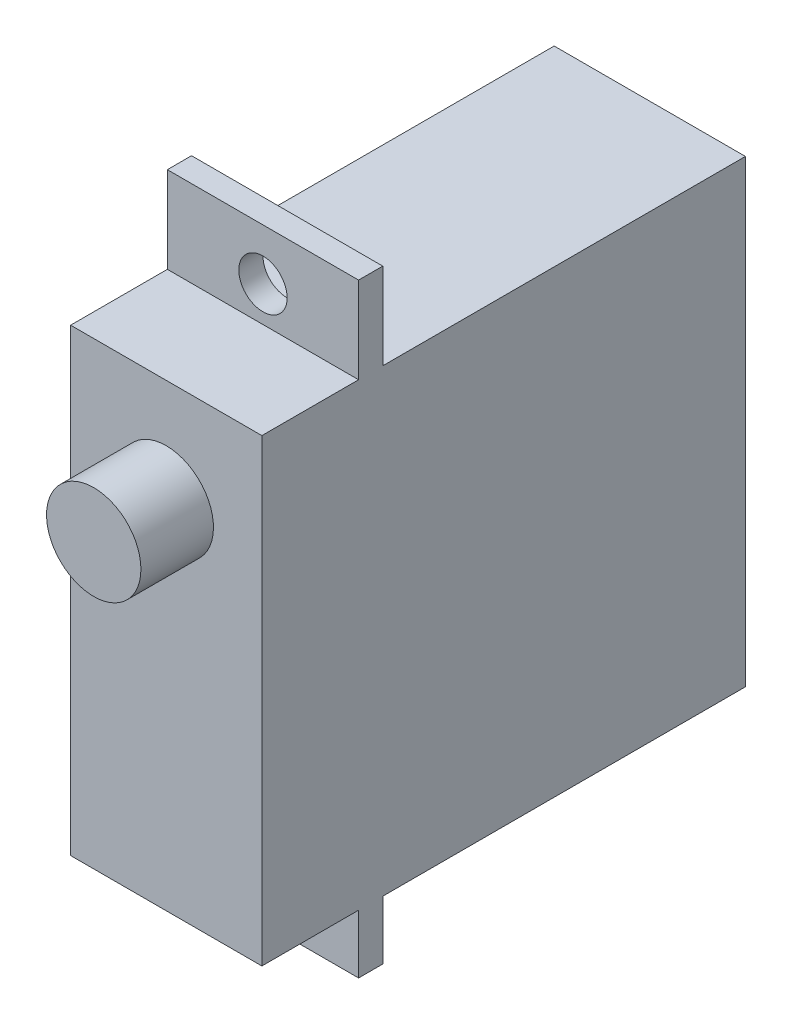
ISO-10303-21;
HEADER;
FILE_DESCRIPTION(('STEP AP214'),'2;1');
FILE_NAME('part.step','',(''),(''),'','','');
FILE_SCHEMA(('AUTOMOTIVE_DESIGN { 1 0 10303 214 1 1 1 1 }'));
ENDSEC;
DATA;
#1=APPLICATION_CONTEXT('core data for automotive mechanical design processes');
#2=APPLICATION_PROTOCOL_DEFINITION('international standard','automotive_design',2000,#1);
#3=PRODUCT_CONTEXT('',#1,'mechanical');
#4=PRODUCT('Part','Part','',(#3));
#5=PRODUCT_RELATED_PRODUCT_CATEGORY('part','',(#4));
#6=PRODUCT_DEFINITION_FORMATION('','',#4);
#7=PRODUCT_DEFINITION_CONTEXT('part definition',#1,'design');
#8=PRODUCT_DEFINITION('design','',#6,#7);
#9=PRODUCT_DEFINITION_SHAPE('','',#8);
#10=(LENGTH_UNIT() NAMED_UNIT(*) SI_UNIT(.MILLI.,.METRE.));
#11=(NAMED_UNIT(*) PLANE_ANGLE_UNIT() SI_UNIT($,.RADIAN.));
#12=(NAMED_UNIT(*) SI_UNIT($,.STERADIAN.) SOLID_ANGLE_UNIT());
#13=UNCERTAINTY_MEASURE_WITH_UNIT(LENGTH_MEASURE(1.E-05),#10,'distance_accuracy_value','');
#14=(GEOMETRIC_REPRESENTATION_CONTEXT(3) GLOBAL_UNCERTAINTY_ASSIGNED_CONTEXT((#13)) GLOBAL_UNIT_ASSIGNED_CONTEXT((#10,
#11,#12)) REPRESENTATION_CONTEXT('',''));
#15=CARTESIAN_POINT('',(0.,0.,0.));
#16=DIRECTION('',(0.,0.,1.));
#17=DIRECTION('',(1.,0.,0.));
#18=AXIS2_PLACEMENT_3D('',#15,#16,#17);
#19=CARTESIAN_POINT('',(-25.0199920063936,-5.80547918733974,13.9600080226867));
#20=DIRECTION('',(0.,-1.,0.));
#21=DIRECTION('',(0.,0.,-1.));
#22=AXIS2_PLACEMENT_3D('',#19,#20,#21);
#23=PLANE('',#22);
#24=DIRECTION('',(0.,0.,1.));
#25=VECTOR('',#24,1.);
#26=CARTESIAN_POINT('',(4.17861745802361,-5.80547918733976,-7.93999197731334));
#27=LINE('',#26,#25);
#28=CARTESIAN_POINT('',(4.17861745802369,-5.80547918733974,12.9600080226867));
#29=VERTEX_POINT('',#28);
#30=CARTESIAN_POINT('',(4.17861745802369,-5.80547918733974,13.9600080226867));
#31=VERTEX_POINT('',#30);
#32=EDGE_CURVE('E50',#29,#31,#27,.T.);
#33=ORIENTED_EDGE('',*,*,#32,.F.);
#34=DIRECTION('',(1.,0.,0.));
#35=VECTOR('',#34,1.);
#36=CARTESIAN_POINT('',(-25.0199920063936,-5.80547918733974,12.9600080226867));
#37=LINE('',#36,#35);
#38=CARTESIAN_POINT('',(7.91,-5.80547918733974,12.9600080226867));
#39=VERTEX_POINT('',#38);
#40=EDGE_CURVE('E157',#29,#39,#37,.T.);
#41=ORIENTED_EDGE('',*,*,#40,.T.);
#42=DIRECTION('',(0.,0.,-1.));
#43=VECTOR('',#42,1.);
#44=CARTESIAN_POINT('',(7.91,-5.80547918733974,13.9600080226867));
#45=LINE('',#44,#43);
#46=CARTESIAN_POINT('',(7.91,-5.80547918733974,13.9600080226867));
#47=VERTEX_POINT('',#46);
#48=EDGE_CURVE('E238',#47,#39,#45,.T.);
#49=ORIENTED_EDGE('',*,*,#48,.F.);
#50=DIRECTION('',(1.,0.,0.));
#51=VECTOR('',#50,1.);
#52=CARTESIAN_POINT('',(-25.0199920063936,-5.80547918733974,13.9600080226867));
#53=LINE('',#52,#51);
#54=EDGE_CURVE('E158',#31,#47,#53,.T.);
#55=ORIENTED_EDGE('',*,*,#54,.F.);
#56=EDGE_LOOP('',(#33,#41,#49,#55));
#57=FACE_BOUND('',#56,.T.);
#58=ADVANCED_FACE('F35',(#57),#23,.T.);
#59=CARTESIAN_POINT('',(7.91,15.6241978014453,17.9600080226867));
#60=DIRECTION('',(0.,-1.,0.));
#61=DIRECTION('',(0.,0.,-1.));
#62=AXIS2_PLACEMENT_3D('',#59,#60,#61);
#63=PLANE('',#62);
#64=DIRECTION('',(-1.,0.,0.));
#65=VECTOR('',#64,1.);
#66=CARTESIAN_POINT('',(7.91,15.6241978014453,12.9600080226867));
#67=LINE('',#66,#65);
#68=CARTESIAN_POINT('',(7.91,15.6241978014453,12.9600080226867));
#69=VERTEX_POINT('',#68);
#70=CARTESIAN_POINT('',(0.,15.6241978014453,12.9600080226867));
#71=VERTEX_POINT('',#70);
#72=EDGE_CURVE('E168',#69,#71,#67,.T.);
#73=ORIENTED_EDGE('',*,*,#72,.F.);
#74=DIRECTION('',(0.,0.,1.));
#75=VECTOR('',#74,1.);
#76=CARTESIAN_POINT('',(7.91,15.6241978014453,17.9600080226867));
#77=LINE('',#76,#75);
#78=CARTESIAN_POINT('',(7.91,15.6241978014453,-2.03999197731334));
#79=VERTEX_POINT('',#78);
#80=EDGE_CURVE('E182',#79,#69,#77,.T.);
#81=ORIENTED_EDGE('',*,*,#80,.F.);
#82=DIRECTION('',(-1.,0.,0.));
#83=VECTOR('',#82,1.);
#84=CARTESIAN_POINT('',(7.91,15.6241978014453,-2.03999197731334));
#85=LINE('',#84,#83);
#86=CARTESIAN_POINT('',(0.,15.6241978014453,-2.03999197731334));
#87=VERTEX_POINT('',#86);
#88=EDGE_CURVE('E141',#79,#87,#85,.T.);
#89=ORIENTED_EDGE('',*,*,#88,.T.);
#90=DIRECTION('',(0.,0.,1.));
#91=VECTOR('',#90,1.);
#92=CARTESIAN_POINT('',(0.,15.6241978014453,17.9600080226867));
#93=LINE('',#92,#91);
#94=EDGE_CURVE('E194',#87,#71,#93,.T.);
#95=ORIENTED_EDGE('',*,*,#94,.T.);
#96=EDGE_LOOP('',(#73,#81,#89,#95));
#97=FACE_BOUND('',#96,.T.);
#98=ADVANCED_FACE('F265',(#97),#63,.F.);
#99=CARTESIAN_POINT('',(7.91,-3.37580219855472,17.9600080226867));
#100=DIRECTION('',(0.,1.,0.));
#101=DIRECTION('',(0.,0.,1.));
#102=AXIS2_PLACEMENT_3D('',#99,#100,#101);
#103=PLANE('',#102);
#104=DIRECTION('',(1.,0.,0.));
#105=VECTOR('',#104,1.);
#106=CARTESIAN_POINT('',(7.91,-3.37580219855472,12.9600080226867));
#107=LINE('',#106,#105);
#108=CARTESIAN_POINT('',(0.,-3.37580219855472,12.9600080226867));
#109=VERTEX_POINT('',#108);
#110=CARTESIAN_POINT('',(7.91,-3.37580219855472,12.9600080226867));
#111=VERTEX_POINT('',#110);
#112=EDGE_CURVE('E166',#109,#111,#107,.T.);
#113=ORIENTED_EDGE('',*,*,#112,.F.);
#114=DIRECTION('',(0.,0.,-1.));
#115=VECTOR('',#114,1.);
#116=CARTESIAN_POINT('',(0.,-3.37580219855472,17.9600080226867));
#117=LINE('',#116,#115);
#118=CARTESIAN_POINT('',(0.,-3.37580219855472,-2.03999197731334));
#119=VERTEX_POINT('',#118);
#120=EDGE_CURVE('E198',#109,#119,#117,.T.);
#121=ORIENTED_EDGE('',*,*,#120,.T.);
#122=DIRECTION('',(-1.,0.,0.));
#123=VECTOR('',#122,1.);
#124=CARTESIAN_POINT('',(7.91,-3.37580219855472,-2.03999197731334));
#125=LINE('',#124,#123);
#126=CARTESIAN_POINT('',(7.91,-3.37580219855472,-2.03999197731334));
#127=VERTEX_POINT('',#126);
#128=EDGE_CURVE('E190',#127,#119,#125,.T.);
#129=ORIENTED_EDGE('',*,*,#128,.F.);
#130=DIRECTION('',(0.,0.,-1.));
#131=VECTOR('',#130,1.);
#132=CARTESIAN_POINT('',(7.91,-3.37580219855472,17.9600080226867));
#133=LINE('',#132,#131);
#134=EDGE_CURVE('E58',#111,#127,#133,.T.);
#135=ORIENTED_EDGE('',*,*,#134,.F.);
#136=EDGE_LOOP('',(#113,#121,#129,#135));
#137=FACE_BOUND('',#136,.T.);
#138=ADVANCED_FACE('F294',(#137),#103,.F.);
#139=CARTESIAN_POINT('',(7.91,15.6241978014453,-2.03999197731334));
#140=DIRECTION('',(0.,0.,1.));
#141=DIRECTION('',(0.,-1.,0.));
#142=AXIS2_PLACEMENT_3D('',#139,#140,#141);
#143=PLANE('',#142);
#144=DIRECTION('',(0.,1.,0.));
#145=VECTOR('',#144,1.);
#146=CARTESIAN_POINT('',(0.,15.6241978014453,-2.03999197731334));
#147=LINE('',#146,#145);
#148=EDGE_CURVE('E176',#119,#87,#147,.T.);
#149=ORIENTED_EDGE('',*,*,#148,.T.);
#150=ORIENTED_EDGE('',*,*,#88,.F.);
#151=DIRECTION('',(0.,1.,0.));
#152=VECTOR('',#151,1.);
#153=CARTESIAN_POINT('',(7.91,15.6241978014453,-2.03999197731334));
#154=LINE('',#153,#152);
#155=EDGE_CURVE('E177',#127,#79,#154,.T.);
#156=ORIENTED_EDGE('',*,*,#155,.F.);
#157=ORIENTED_EDGE('',*,*,#128,.T.);
#158=EDGE_LOOP('',(#149,#150,#156,#157));
#159=FACE_BOUND('',#158,.T.);
#160=ADVANCED_FACE('F37',(#159),#143,.F.);
#161=CARTESIAN_POINT('',(7.91,15.6241978014453,13.9600080226867));
#162=VERTEX_POINT('',#161);
#163=CARTESIAN_POINT('',(7.91,15.6241978014453,17.9600080226867));
#164=VERTEX_POINT('',#163);
#165=EDGE_CURVE('E180',#162,#164,#77,.T.);
#166=ORIENTED_EDGE('',*,*,#165,.F.);
#167=DIRECTION('',(-1.,0.,0.));
#168=VECTOR('',#167,1.);
#169=CARTESIAN_POINT('',(7.91,15.6241978014453,13.9600080226867));
#170=LINE('',#169,#168);
#171=CARTESIAN_POINT('',(0.,15.6241978014453,13.9600080226867));
#172=VERTEX_POINT('',#171);
#173=EDGE_CURVE('E173',#162,#172,#170,.T.);
#174=ORIENTED_EDGE('',*,*,#173,.T.);
#175=CARTESIAN_POINT('',(0.,15.6241978014453,17.9600080226867));
#176=VERTEX_POINT('',#175);
#177=EDGE_CURVE('E193',#172,#176,#93,.T.);
#178=ORIENTED_EDGE('',*,*,#177,.T.);
#179=DIRECTION('',(-1.,0.,0.));
#180=VECTOR('',#179,1.);
#181=CARTESIAN_POINT('',(7.91,15.6241978014453,17.9600080226867));
#182=LINE('',#181,#180);
#183=EDGE_CURVE('E205',#164,#176,#182,.T.);
#184=ORIENTED_EDGE('',*,*,#183,.F.);
#185=EDGE_LOOP('',(#166,#174,#178,#184));
#186=FACE_BOUND('',#185,.T.);
#187=ADVANCED_FACE('F277',(#186),#63,.F.);
#188=CARTESIAN_POINT('',(7.91,15.6241978014453,17.9600080226867));
#189=DIRECTION('',(0.,0.,-1.));
#190=DIRECTION('',(0.,1.,0.));
#191=AXIS2_PLACEMENT_3D('',#188,#189,#190);
#192=PLANE('',#191);
#193=CARTESIAN_POINT('',(3.955,11.3331948655234,17.9600080226867));
#194=DIRECTION('',(0.,0.,-1.));
#195=DIRECTION('',(0.,1.,0.));
#196=AXIS2_PLACEMENT_3D('',#193,#194,#195);
#197=CIRCLE('',#196,1.95158077469917);
#198=CARTESIAN_POINT('',(3.955,13.2847756402225,17.9600080226867));
#199=VERTEX_POINT('',#198);
#200=EDGE_CURVE('E11',#199,#199,#197,.F.);
#201=ORIENTED_EDGE('',*,*,#200,.F.);
#202=EDGE_LOOP('',(#201));
#203=FACE_BOUND('',#202,.T.);
#204=DIRECTION('',(0.,-1.,0.));
#205=VECTOR('',#204,1.);
#206=CARTESIAN_POINT('',(0.,15.6241978014453,17.9600080226867));
#207=LINE('',#206,#205);
#208=CARTESIAN_POINT('',(0.,-3.37580219855472,17.9600080226867));
#209=VERTEX_POINT('',#208);
#210=EDGE_CURVE('E196',#176,#209,#207,.T.);
#211=ORIENTED_EDGE('',*,*,#210,.T.);
#212=DIRECTION('',(-1.,0.,0.));
#213=VECTOR('',#212,1.);
#214=CARTESIAN_POINT('',(7.91,-3.37580219855472,17.9600080226867));
#215=LINE('',#214,#213);
#216=CARTESIAN_POINT('',(7.91,-3.37580219855472,17.9600080226867));
#217=VERTEX_POINT('',#216);
#218=EDGE_CURVE('E202',#217,#209,#215,.T.);
#219=ORIENTED_EDGE('',*,*,#218,.F.);
#220=DIRECTION('',(0.,-1.,0.));
#221=VECTOR('',#220,1.);
#222=CARTESIAN_POINT('',(7.91,15.6241978014453,17.9600080226867));
#223=LINE('',#222,#221);
#224=EDGE_CURVE('E185',#164,#217,#223,.T.);
#225=ORIENTED_EDGE('',*,*,#224,.F.);
#226=ORIENTED_EDGE('',*,*,#183,.T.);
#227=EDGE_LOOP('',(#211,#219,#225,#226));
#228=FACE_BOUND('',#227,.T.);
#229=ADVANCED_FACE('F280',(#203,#228),#192,.F.);
#230=CARTESIAN_POINT('',(0.,-3.37580219855472,13.9600080226867));
#231=VERTEX_POINT('',#230);
#232=EDGE_CURVE('E181',#209,#231,#117,.T.);
#233=ORIENTED_EDGE('',*,*,#232,.T.);
#234=DIRECTION('',(1.,0.,0.));
#235=VECTOR('',#234,1.);
#236=CARTESIAN_POINT('',(7.91,-3.37580219855472,13.9600080226867));
#237=LINE('',#236,#235);
#238=CARTESIAN_POINT('',(7.91,-3.37580219855472,13.9600080226867));
#239=VERTEX_POINT('',#238);
#240=EDGE_CURVE('E171',#231,#239,#237,.T.);
#241=ORIENTED_EDGE('',*,*,#240,.T.);
#242=EDGE_CURVE('E187',#217,#239,#133,.T.);
#243=ORIENTED_EDGE('',*,*,#242,.F.);
#244=ORIENTED_EDGE('',*,*,#218,.T.);
#245=EDGE_LOOP('',(#233,#241,#243,#244));
#246=FACE_BOUND('',#245,.T.);
#247=ADVANCED_FACE('F284',(#246),#103,.F.);
#248=CARTESIAN_POINT('',(7.91,0.,0.));
#249=DIRECTION('',(1.,0.,0.));
#250=DIRECTION('',(0.,0.,-1.));
#251=AXIS2_PLACEMENT_3D('',#248,#249,#250);
#252=PLANE('',#251);
#253=ORIENTED_EDGE('',*,*,#242,.T.);
#254=DIRECTION('',(0.,-1.,0.));
#255=VECTOR('',#254,1.);
#256=CARTESIAN_POINT('',(7.91,19.1945208126603,13.9600080226867));
#257=LINE('',#256,#255);
#258=EDGE_CURVE('E225',#239,#47,#257,.T.);
#259=ORIENTED_EDGE('',*,*,#258,.T.);
#260=ORIENTED_EDGE('',*,*,#48,.T.);
#261=DIRECTION('',(0.,-1.,0.));
#262=VECTOR('',#261,1.);
#263=CARTESIAN_POINT('',(7.91,19.1945208126603,12.9600080226867));
#264=LINE('',#263,#262);
#265=EDGE_CURVE('E241',#111,#39,#264,.T.);
#266=ORIENTED_EDGE('',*,*,#265,.F.);
#267=ORIENTED_EDGE('',*,*,#134,.T.);
#268=ORIENTED_EDGE('',*,*,#155,.T.);
#269=ORIENTED_EDGE('',*,*,#80,.T.);
#270=CARTESIAN_POINT('',(7.91,19.1945208126603,12.9600080226867));
#271=VERTEX_POINT('',#270);
#272=EDGE_CURVE('E242',#271,#69,#264,.T.);
#273=ORIENTED_EDGE('',*,*,#272,.F.);
#274=DIRECTION('',(0.,0.,-1.));
#275=VECTOR('',#274,1.);
#276=CARTESIAN_POINT('',(7.91,19.1945208126603,13.9600080226867));
#277=LINE('',#276,#275);
#278=CARTESIAN_POINT('',(7.91,19.1945208126603,13.9600080226867));
#279=VERTEX_POINT('',#278);
#280=EDGE_CURVE('E161',#279,#271,#277,.T.);
#281=ORIENTED_EDGE('',*,*,#280,.F.);
#282=EDGE_CURVE('E235',#279,#162,#257,.T.);
#283=ORIENTED_EDGE('',*,*,#282,.T.);
#284=ORIENTED_EDGE('',*,*,#165,.T.);
#285=ORIENTED_EDGE('',*,*,#224,.T.);
#286=EDGE_LOOP('',(#253,#259,#260,#266,#267,#268,#269,#273,#281,#283,#284,#285));
#287=FACE_BOUND('',#286,.T.);
#288=ADVANCED_FACE('F261',(#287),#252,.T.);
#289=CARTESIAN_POINT('',(0.,0.,0.));
#290=DIRECTION('',(1.,0.,0.));
#291=DIRECTION('',(0.,0.,-1.));
#292=AXIS2_PLACEMENT_3D('',#289,#290,#291);
#293=PLANE('',#292);
#294=ORIENTED_EDGE('',*,*,#177,.F.);
#295=DIRECTION('',(0.,1.,0.));
#296=VECTOR('',#295,1.);
#297=CARTESIAN_POINT('',(0.,19.1945208126603,13.9600080226867));
#298=LINE('',#297,#296);
#299=CARTESIAN_POINT('',(0.,19.1945208126603,13.9600080226867));
#300=VERTEX_POINT('',#299);
#301=EDGE_CURVE('E233',#172,#300,#298,.T.);
#302=ORIENTED_EDGE('',*,*,#301,.T.);
#303=DIRECTION('',(0.,0.,1.));
#304=VECTOR('',#303,1.);
#305=CARTESIAN_POINT('',(0.,19.1945208126603,13.9600080226867));
#306=LINE('',#305,#304);
#307=CARTESIAN_POINT('',(0.,19.1945208126603,12.9600080226867));
#308=VERTEX_POINT('',#307);
#309=EDGE_CURVE('E229',#308,#300,#306,.T.);
#310=ORIENTED_EDGE('',*,*,#309,.F.);
#311=DIRECTION('',(0.,1.,0.));
#312=VECTOR('',#311,1.);
#313=CARTESIAN_POINT('',(0.,19.1945208126603,12.9600080226867));
#314=LINE('',#313,#312);
#315=EDGE_CURVE('E230',#71,#308,#314,.T.);
#316=ORIENTED_EDGE('',*,*,#315,.F.);
#317=ORIENTED_EDGE('',*,*,#94,.F.);
#318=ORIENTED_EDGE('',*,*,#148,.F.);
#319=ORIENTED_EDGE('',*,*,#120,.F.);
#320=CARTESIAN_POINT('',(0.,-5.80547918733974,12.9600080226867));
#321=VERTEX_POINT('',#320);
#322=EDGE_CURVE('E226',#321,#109,#314,.T.);
#323=ORIENTED_EDGE('',*,*,#322,.F.);
#324=DIRECTION('',(0.,0.,1.));
#325=VECTOR('',#324,1.);
#326=CARTESIAN_POINT('',(0.,-5.80547918733974,13.9600080226867));
#327=LINE('',#326,#325);
#328=CARTESIAN_POINT('',(0.,-5.80547918733974,13.9600080226867));
#329=VERTEX_POINT('',#328);
#330=EDGE_CURVE('E164',#321,#329,#327,.T.);
#331=ORIENTED_EDGE('',*,*,#330,.T.);
#332=EDGE_CURVE('E156',#329,#231,#298,.T.);
#333=ORIENTED_EDGE('',*,*,#332,.T.);
#334=ORIENTED_EDGE('',*,*,#232,.F.);
#335=ORIENTED_EDGE('',*,*,#210,.F.);
#336=EDGE_LOOP('',(#294,#302,#310,#316,#317,#318,#319,#323,#331,#333,#334,#335));
#337=FACE_BOUND('',#336,.T.);
#338=ADVANCED_FACE('F267',(#337),#293,.F.);
#339=DIRECTION('',(0.,0.,1.));
#340=VECTOR('',#339,1.);
#341=CARTESIAN_POINT('',(3.73138254197639,-5.80547918733976,-7.93999197731334));
#342=LINE('',#341,#340);
#343=CARTESIAN_POINT('',(3.73138254197631,-5.80547918733974,13.9600080226867));
#344=VERTEX_POINT('',#343);
#345=CARTESIAN_POINT('',(3.73138254197631,-5.80547918733974,12.9600080226867));
#346=VERTEX_POINT('',#345);
#347=EDGE_CURVE('E136',#344,#346,#342,.F.);
#348=ORIENTED_EDGE('',*,*,#347,.F.);
#349=EDGE_CURVE('E147',#329,#344,#53,.T.);
#350=ORIENTED_EDGE('',*,*,#349,.F.);
#351=ORIENTED_EDGE('',*,*,#330,.F.);
#352=EDGE_CURVE('E149',#321,#346,#37,.T.);
#353=ORIENTED_EDGE('',*,*,#352,.T.);
#354=EDGE_LOOP('',(#348,#350,#351,#353));
#355=FACE_BOUND('',#354,.T.);
#356=ADVANCED_FACE('F145',(#355),#23,.T.);
#357=CARTESIAN_POINT('',(-25.0199920063936,19.1945208126603,12.9600080226867));
#358=DIRECTION('',(0.,0.,1.));
#359=DIRECTION('',(0.,-1.,0.));
#360=AXIS2_PLACEMENT_3D('',#357,#358,#359);
#361=PLANE('',#360);
#362=ORIENTED_EDGE('',*,*,#40,.F.);
#363=CARTESIAN_POINT('',(3.955,-4.83080219855472,12.9600080226867));
#364=DIRECTION('',(0.,0.,1.));
#365=DIRECTION('',(0.,-1.,0.));
#366=AXIS2_PLACEMENT_3D('',#363,#364,#365);
#367=CIRCLE('',#366,1.);
#368=EDGE_CURVE('E150',#29,#346,#367,.T.);
#369=ORIENTED_EDGE('',*,*,#368,.T.);
#370=ORIENTED_EDGE('',*,*,#352,.F.);
#371=ORIENTED_EDGE('',*,*,#322,.T.);
#372=ORIENTED_EDGE('',*,*,#112,.T.);
#373=ORIENTED_EDGE('',*,*,#265,.T.);
#374=EDGE_LOOP('',(#362,#369,#370,#371,#372,#373));
#375=FACE_BOUND('',#374,.T.);
#376=ADVANCED_FACE('F293',(#375),#361,.F.);
#377=CARTESIAN_POINT('',(-25.0199920063936,19.1945208126603,13.9600080226867));
#378=DIRECTION('',(0.,0.,1.));
#379=DIRECTION('',(0.,-1.,0.));
#380=AXIS2_PLACEMENT_3D('',#377,#378,#379);
#381=PLANE('',#380);
#382=CARTESIAN_POINT('',(3.955,-4.83080219855472,13.9600080226867));
#383=DIRECTION('',(0.,0.,1.));
#384=DIRECTION('',(0.,-1.,0.));
#385=AXIS2_PLACEMENT_3D('',#382,#383,#384);
#386=CIRCLE('',#385,1.);
#387=EDGE_CURVE('E43',#31,#344,#386,.T.);
#388=ORIENTED_EDGE('',*,*,#387,.F.);
#389=ORIENTED_EDGE('',*,*,#54,.T.);
#390=ORIENTED_EDGE('',*,*,#258,.F.);
#391=ORIENTED_EDGE('',*,*,#240,.F.);
#392=ORIENTED_EDGE('',*,*,#332,.F.);
#393=ORIENTED_EDGE('',*,*,#349,.T.);
#394=EDGE_LOOP('',(#388,#389,#390,#391,#392,#393));
#395=FACE_BOUND('',#394,.T.);
#396=ADVANCED_FACE('F153',(#395),#381,.T.);
#397=CARTESIAN_POINT('',(3.955,17.0791978014453,13.9600080226867));
#398=DIRECTION('',(0.,0.,1.));
#399=DIRECTION('',(1.,0.,0.));
#400=AXIS2_PLACEMENT_3D('',#397,#398,#399);
#401=CIRCLE('',#400,1.);
#402=CARTESIAN_POINT('',(4.955,17.0791978014453,13.9600080226867));
#403=VERTEX_POINT('',#402);
#404=EDGE_CURVE('E212',#403,#403,#401,.T.);
#405=ORIENTED_EDGE('',*,*,#404,.F.);
#406=EDGE_LOOP('',(#405));
#407=FACE_BOUND('',#406,.T.);
#408=ORIENTED_EDGE('',*,*,#173,.F.);
#409=ORIENTED_EDGE('',*,*,#282,.F.);
#410=DIRECTION('',(1.,0.,0.));
#411=VECTOR('',#410,1.);
#412=CARTESIAN_POINT('',(-25.0199920063936,19.1945208126603,13.9600080226867));
#413=LINE('',#412,#411);
#414=EDGE_CURVE('E247',#300,#279,#413,.T.);
#415=ORIENTED_EDGE('',*,*,#414,.F.);
#416=ORIENTED_EDGE('',*,*,#301,.F.);
#417=EDGE_LOOP('',(#408,#409,#415,#416));
#418=FACE_BOUND('',#417,.T.);
#419=ADVANCED_FACE('F272',(#407,#418),#381,.T.);
#420=CARTESIAN_POINT('',(3.955,17.0791978014453,12.9600080226867));
#421=DIRECTION('',(0.,0.,1.));
#422=DIRECTION('',(0.,-1.,0.));
#423=AXIS2_PLACEMENT_3D('',#420,#421,#422);
#424=CIRCLE('',#423,1.);
#425=CARTESIAN_POINT('',(3.955,16.0791978014453,12.9600080226867));
#426=VERTEX_POINT('',#425);
#427=EDGE_CURVE('E210',#426,#426,#424,.T.);
#428=ORIENTED_EDGE('',*,*,#427,.T.);
#429=EDGE_LOOP('',(#428));
#430=FACE_BOUND('',#429,.T.);
#431=ORIENTED_EDGE('',*,*,#272,.T.);
#432=ORIENTED_EDGE('',*,*,#72,.T.);
#433=ORIENTED_EDGE('',*,*,#315,.T.);
#434=DIRECTION('',(1.,0.,0.));
#435=VECTOR('',#434,1.);
#436=CARTESIAN_POINT('',(-25.0199920063936,19.1945208126603,12.9600080226867));
#437=LINE('',#436,#435);
#438=EDGE_CURVE('E248',#308,#271,#437,.T.);
#439=ORIENTED_EDGE('',*,*,#438,.T.);
#440=EDGE_LOOP('',(#431,#432,#433,#439));
#441=FACE_BOUND('',#440,.T.);
#442=ADVANCED_FACE('F251',(#430,#441),#361,.F.);
#443=CARTESIAN_POINT('',(-25.0199920063936,19.1945208126603,13.9600080226867));
#444=DIRECTION('',(0.,-1.,0.));
#445=DIRECTION('',(0.,0.,-1.));
#446=AXIS2_PLACEMENT_3D('',#443,#444,#445);
#447=PLANE('',#446);
#448=ORIENTED_EDGE('',*,*,#438,.F.);
#449=ORIENTED_EDGE('',*,*,#309,.T.);
#450=ORIENTED_EDGE('',*,*,#414,.T.);
#451=ORIENTED_EDGE('',*,*,#280,.T.);
#452=EDGE_LOOP('',(#448,#449,#450,#451));
#453=FACE_BOUND('',#452,.T.);
#454=ADVANCED_FACE('F257',(#453),#447,.F.);
#455=CARTESIAN_POINT('',(3.955,17.0791978014453,-7.93999197731334));
#456=DIRECTION('',(0.,0.,1.));
#457=DIRECTION('',(1.,0.,0.));
#458=AXIS2_PLACEMENT_3D('',#455,#456,#457);
#459=CYLINDRICAL_SURFACE('',#458,1.);
#460=ORIENTED_EDGE('',*,*,#404,.T.);
#461=EDGE_LOOP('',(#460));
#462=FACE_BOUND('',#461,.T.);
#463=ORIENTED_EDGE('',*,*,#427,.F.);
#464=EDGE_LOOP('',(#463));
#465=FACE_BOUND('',#464,.T.);
#466=ADVANCED_FACE('F338',(#462,#465),#459,.F.);
#467=CARTESIAN_POINT('',(3.955,-4.83080219855472,-7.93999197731334));
#468=DIRECTION('',(0.,0.,1.));
#469=DIRECTION('',(1.,0.,0.));
#470=AXIS2_PLACEMENT_3D('',#467,#468,#469);
#471=CYLINDRICAL_SURFACE('',#470,1.);
#472=ORIENTED_EDGE('',*,*,#32,.T.);
#473=ORIENTED_EDGE('',*,*,#387,.T.);
#474=ORIENTED_EDGE('',*,*,#347,.T.);
#475=ORIENTED_EDGE('',*,*,#368,.F.);
#476=EDGE_LOOP('',(#472,#473,#474,#475));
#477=FACE_BOUND('',#476,.T.);
#478=ADVANCED_FACE('F135',(#477),#471,.F.);
#479=CARTESIAN_POINT('',(3.955,11.3331948655234,20.9600080226867));
#480=DIRECTION('',(0.,0.,-1.));
#481=DIRECTION('',(-1.,0.,0.));
#482=AXIS2_PLACEMENT_3D('',#479,#480,#481);
#483=CYLINDRICAL_SURFACE('',#482,1.95158077469917);
#484=CARTESIAN_POINT('',(3.955,11.3331948655234,20.9600080226867));
#485=DIRECTION('',(0.,0.,1.));
#486=DIRECTION('',(1.,0.,0.));
#487=AXIS2_PLACEMENT_3D('',#484,#485,#486);
#488=CIRCLE('',#487,1.95158077469917);
#489=CARTESIAN_POINT('',(5.90658077469917,11.3331948655234,20.9600080226867));
#490=VERTEX_POINT('',#489);
#491=EDGE_CURVE('E217',#490,#490,#488,.T.);
#492=ORIENTED_EDGE('',*,*,#491,.F.);
#493=EDGE_LOOP('',(#492));
#494=FACE_BOUND('',#493,.T.);
#495=ORIENTED_EDGE('',*,*,#200,.T.);
#496=EDGE_LOOP('',(#495));
#497=FACE_BOUND('',#496,.T.);
#498=ADVANCED_FACE('F327',(#494,#497),#483,.T.);
#499=CARTESIAN_POINT('',(3.955,11.3331948655234,20.9600080226867));
#500=DIRECTION('',(0.,0.,1.));
#501=DIRECTION('',(1.,0.,0.));
#502=AXIS2_PLACEMENT_3D('',#499,#500,#501);
#503=PLANE('',#502);
#504=ORIENTED_EDGE('',*,*,#491,.T.);
#505=EDGE_LOOP('',(#504));
#506=FACE_BOUND('',#505,.T.);
#507=ADVANCED_FACE('F329',(#506),#503,.T.);
#508=CLOSED_SHELL('',(#58,#98,#138,#160,#187,#229,#247,#288,#338,#356,#376,#396,#419,#442,#454,
#466,#478,#498,#507));
#509=MANIFOLD_SOLID_BREP('B2',#508);
#510=ADVANCED_BREP_SHAPE_REPRESENTATION('',(#18,#509),#14);
#511=SHAPE_DEFINITION_REPRESENTATION(#9,#510);
ENDSEC;
END-ISO-10303-21;
